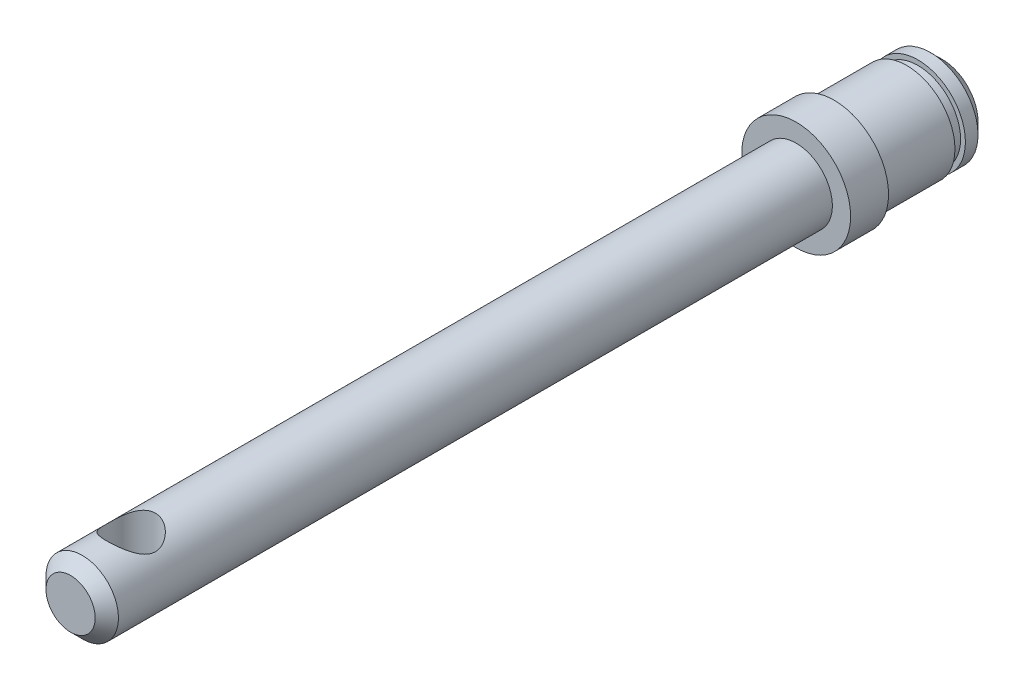
ISO-10303-21;
HEADER;
FILE_DESCRIPTION(('STEP AP214'),'2;1');
FILE_NAME('part.step','',(''),(''),'','','');
FILE_SCHEMA(('AUTOMOTIVE_DESIGN { 1 0 10303 214 1 1 1 1 }'));
ENDSEC;
DATA;
#1=APPLICATION_CONTEXT('core data for automotive mechanical design processes');
#2=APPLICATION_PROTOCOL_DEFINITION('international standard','automotive_design',2000,#1);
#3=PRODUCT_CONTEXT('',#1,'mechanical');
#4=PRODUCT('Part','Part','',(#3));
#5=PRODUCT_RELATED_PRODUCT_CATEGORY('part','',(#4));
#6=PRODUCT_DEFINITION_FORMATION('','',#4);
#7=PRODUCT_DEFINITION_CONTEXT('part definition',#1,'design');
#8=PRODUCT_DEFINITION('design','',#6,#7);
#9=PRODUCT_DEFINITION_SHAPE('','',#8);
#10=(LENGTH_UNIT() NAMED_UNIT(*) SI_UNIT(.MILLI.,.METRE.));
#11=(NAMED_UNIT(*) PLANE_ANGLE_UNIT() SI_UNIT($,.RADIAN.));
#12=(NAMED_UNIT(*) SI_UNIT($,.STERADIAN.) SOLID_ANGLE_UNIT());
#13=UNCERTAINTY_MEASURE_WITH_UNIT(LENGTH_MEASURE(1.E-05),#10,'distance_accuracy_value','');
#14=(GEOMETRIC_REPRESENTATION_CONTEXT(3) GLOBAL_UNCERTAINTY_ASSIGNED_CONTEXT((#13)) GLOBAL_UNIT_ASSIGNED_CONTEXT((#10,
#11,#12)) REPRESENTATION_CONTEXT('',''));
#15=CARTESIAN_POINT('',(0.,0.,0.));
#16=DIRECTION('',(0.,0.,1.));
#17=DIRECTION('',(1.,0.,0.));
#18=AXIS2_PLACEMENT_3D('',#15,#16,#17);
#19=CARTESIAN_POINT('',(0.,0.,-9.5758));
#20=DIRECTION('',(0.,0.,-1.));
#21=DIRECTION('',(-1.,0.,0.));
#22=AXIS2_PLACEMENT_3D('',#19,#20,#21);
#23=PLANE('',#22);
#24=CARTESIAN_POINT('',(0.,0.,-9.57579999993641));
#25=DIRECTION('',(0.,0.,1.));
#26=DIRECTION('',(1.,0.,0.));
#27=AXIS2_PLACEMENT_3D('',#24,#25,#26);
#28=CIRCLE('',#27,2.3494999999798);
#29=CARTESIAN_POINT('',(2.3494999999798,0.,-9.57579999993641));
#30=VERTEX_POINT('',#29);
#31=EDGE_CURVE('E18',#30,#30,#28,.T.);
#32=ORIENTED_EDGE('',*,*,#31,.F.);
#33=EDGE_LOOP('',(#32));
#34=FACE_BOUND('',#33,.T.);
#35=ADVANCED_FACE('F15',(#34),#23,.T.);
#36=CARTESIAN_POINT('',(0.,0.,-8.81380000009813));
#37=DIRECTION('',(0.,0.,1.));
#38=DIRECTION('',(1.,0.,0.));
#39=AXIS2_PLACEMENT_3D('',#36,#37,#38);
#40=CONICAL_SURFACE('',#39,3.11149999987492,0.785398163434747);
#41=ORIENTED_EDGE('',*,*,#31,.T.);
#42=EDGE_LOOP('',(#41));
#43=FACE_BOUND('',#42,.T.);
#44=CARTESIAN_POINT('',(0.,0.,-8.8138));
#45=DIRECTION('',(0.,0.,1.));
#46=DIRECTION('',(1.,0.,0.));
#47=AXIS2_PLACEMENT_3D('',#44,#45,#46);
#48=CIRCLE('',#47,3.1115);
#49=CARTESIAN_POINT('',(3.1115,0.,-8.8138));
#50=VERTEX_POINT('',#49);
#51=EDGE_CURVE('E34',#50,#50,#48,.T.);
#52=ORIENTED_EDGE('',*,*,#51,.F.);
#53=EDGE_LOOP('',(#52));
#54=FACE_BOUND('',#53,.T.);
#55=ADVANCED_FACE('F80',(#43,#54),#40,.T.);
#56=CARTESIAN_POINT('',(0.,0.,-9.5758));
#57=DIRECTION('',(0.,0.,1.));
#58=DIRECTION('',(1.,0.,0.));
#59=AXIS2_PLACEMENT_3D('',#56,#57,#58);
#60=CYLINDRICAL_SURFACE('',#59,3.1115);
#61=ORIENTED_EDGE('',*,*,#51,.T.);
#62=EDGE_LOOP('',(#61));
#63=FACE_BOUND('',#62,.T.);
#64=CARTESIAN_POINT('',(0.,0.,-7.9883));
#65=DIRECTION('',(0.,0.,1.));
#66=DIRECTION('',(1.,0.,0.));
#67=AXIS2_PLACEMENT_3D('',#64,#65,#66);
#68=CIRCLE('',#67,3.1115);
#69=CARTESIAN_POINT('',(3.1115,0.,-7.9883));
#70=VERTEX_POINT('',#69);
#71=EDGE_CURVE('E70',#70,#70,#68,.F.);
#72=ORIENTED_EDGE('',*,*,#71,.T.);
#73=EDGE_LOOP('',(#72));
#74=FACE_BOUND('',#73,.T.);
#75=ADVANCED_FACE('F88',(#63,#74),#60,.T.);
#76=CARTESIAN_POINT('',(0.,0.,-7.9883));
#77=DIRECTION('',(0.,0.,-1.));
#78=DIRECTION('',(-1.,0.,0.));
#79=AXIS2_PLACEMENT_3D('',#76,#77,#78);
#80=PLANE('',#79);
#81=CARTESIAN_POINT('',(0.,0.,-7.9883));
#82=DIRECTION('',(0.,0.,1.));
#83=DIRECTION('',(1.,0.,0.));
#84=AXIS2_PLACEMENT_3D('',#81,#82,#83);
#85=CIRCLE('',#84,2.794);
#86=CARTESIAN_POINT('',(2.794,0.,-7.9883));
#87=VERTEX_POINT('',#86);
#88=EDGE_CURVE('E68',#87,#87,#85,.T.);
#89=ORIENTED_EDGE('',*,*,#88,.F.);
#90=EDGE_LOOP('',(#89));
#91=FACE_BOUND('',#90,.T.);
#92=ORIENTED_EDGE('',*,*,#71,.F.);
#93=EDGE_LOOP('',(#92));
#94=FACE_BOUND('',#93,.T.);
#95=ADVANCED_FACE('F93',(#91,#94),#80,.F.);
#96=CARTESIAN_POINT('',(0.,0.,-7.9883));
#97=DIRECTION('',(0.,0.,1.));
#98=DIRECTION('',(1.,0.,0.));
#99=AXIS2_PLACEMENT_3D('',#96,#97,#98);
#100=CYLINDRICAL_SURFACE('',#99,2.794);
#101=CARTESIAN_POINT('',(0.,0.,-7.2517));
#102=DIRECTION('',(0.,0.,1.));
#103=DIRECTION('',(1.,0.,0.));
#104=AXIS2_PLACEMENT_3D('',#101,#102,#103);
#105=CIRCLE('',#104,2.794);
#106=CARTESIAN_POINT('',(2.794,0.,-7.2517));
#107=VERTEX_POINT('',#106);
#108=EDGE_CURVE('E65',#107,#107,#105,.T.);
#109=ORIENTED_EDGE('',*,*,#108,.F.);
#110=EDGE_LOOP('',(#109));
#111=FACE_BOUND('',#110,.T.);
#112=ORIENTED_EDGE('',*,*,#88,.T.);
#113=EDGE_LOOP('',(#112));
#114=FACE_BOUND('',#113,.T.);
#115=ADVANCED_FACE('F98',(#111,#114),#100,.T.);
#116=CARTESIAN_POINT('',(0.,0.,-7.2517));
#117=DIRECTION('',(0.,0.,-1.));
#118=DIRECTION('',(-1.,0.,0.));
#119=AXIS2_PLACEMENT_3D('',#116,#117,#118);
#120=PLANE('',#119);
#121=ORIENTED_EDGE('',*,*,#108,.T.);
#122=EDGE_LOOP('',(#121));
#123=FACE_BOUND('',#122,.T.);
#124=CARTESIAN_POINT('',(0.,0.,-7.2517));
#125=DIRECTION('',(0.,0.,1.));
#126=DIRECTION('',(1.,0.,0.));
#127=AXIS2_PLACEMENT_3D('',#124,#125,#126);
#128=CIRCLE('',#127,3.1623);
#129=CARTESIAN_POINT('',(3.1623,0.,-7.2517));
#130=VERTEX_POINT('',#129);
#131=EDGE_CURVE('E62',#130,#130,#128,.T.);
#132=ORIENTED_EDGE('',*,*,#131,.F.);
#133=EDGE_LOOP('',(#132));
#134=FACE_BOUND('',#133,.T.);
#135=ADVANCED_FACE('F102',(#123,#134),#120,.T.);
#136=CARTESIAN_POINT('',(0.,0.,-7.2517));
#137=DIRECTION('',(0.,0.,1.));
#138=DIRECTION('',(1.,0.,0.));
#139=AXIS2_PLACEMENT_3D('',#136,#137,#138);
#140=CYLINDRICAL_SURFACE('',#139,3.1623);
#141=ORIENTED_EDGE('',*,*,#131,.T.);
#142=EDGE_LOOP('',(#141));
#143=FACE_BOUND('',#142,.T.);
#144=CARTESIAN_POINT('',(0.,0.,-2.4892));
#145=DIRECTION('',(0.,0.,1.));
#146=DIRECTION('',(1.,0.,0.));
#147=AXIS2_PLACEMENT_3D('',#144,#145,#146);
#148=CIRCLE('',#147,3.1623);
#149=CARTESIAN_POINT('',(3.1623,0.,-2.4892));
#150=VERTEX_POINT('',#149);
#151=EDGE_CURVE('E59',#150,#150,#148,.F.);
#152=ORIENTED_EDGE('',*,*,#151,.T.);
#153=EDGE_LOOP('',(#152));
#154=FACE_BOUND('',#153,.T.);
#155=ADVANCED_FACE('F106',(#143,#154),#140,.T.);
#156=CARTESIAN_POINT('',(0.,0.,-2.4892));
#157=DIRECTION('',(0.,0.,1.));
#158=DIRECTION('',(1.,0.,0.));
#159=AXIS2_PLACEMENT_3D('',#156,#157,#158);
#160=PLANE('',#159);
#161=ORIENTED_EDGE('',*,*,#151,.F.);
#162=EDGE_LOOP('',(#161));
#163=FACE_BOUND('',#162,.T.);
#164=CARTESIAN_POINT('',(0.,0.,-2.4892));
#165=DIRECTION('',(0.,0.,1.));
#166=DIRECTION('',(1.,0.,0.));
#167=AXIS2_PLACEMENT_3D('',#164,#165,#166);
#168=CIRCLE('',#167,3.571875);
#169=CARTESIAN_POINT('',(3.571875,0.,-2.4892));
#170=VERTEX_POINT('',#169);
#171=EDGE_CURVE('E56',#170,#170,#168,.T.);
#172=ORIENTED_EDGE('',*,*,#171,.F.);
#173=EDGE_LOOP('',(#172));
#174=FACE_BOUND('',#173,.T.);
#175=ADVANCED_FACE('F110',(#163,#174),#160,.F.);
#176=CARTESIAN_POINT('',(0.,0.,47.5742));
#177=DIRECTION('',(0.,0.,1.));
#178=DIRECTION('',(1.,0.,0.));
#179=AXIS2_PLACEMENT_3D('',#176,#177,#178);
#180=PLANE('',#179);
#181=CARTESIAN_POINT('',(0.,0.,47.5741999999855));
#182=DIRECTION('',(0.,0.,-1.));
#183=DIRECTION('',(-1.,0.,0.));
#184=AXIS2_PLACEMENT_3D('',#181,#182,#183);
#185=CIRCLE('',#184,1.61289999999781);
#186=CARTESIAN_POINT('',(-1.61289999999781,0.,47.5741999999855));
#187=VERTEX_POINT('',#186);
#188=EDGE_CURVE('E53',#187,#187,#185,.T.);
#189=ORIENTED_EDGE('',*,*,#188,.F.);
#190=EDGE_LOOP('',(#189));
#191=FACE_BOUND('',#190,.T.);
#192=ADVANCED_FACE('F114',(#191),#180,.T.);
#193=CARTESIAN_POINT('',(0.,0.,-2.4892));
#194=DIRECTION('',(0.,0.,1.));
#195=DIRECTION('',(1.,0.,0.));
#196=AXIS2_PLACEMENT_3D('',#193,#194,#195);
#197=CYLINDRICAL_SURFACE('',#196,3.571875);
#198=ORIENTED_EDGE('',*,*,#171,.T.);
#199=EDGE_LOOP('',(#198));
#200=FACE_BOUND('',#199,.T.);
#201=CARTESIAN_POINT('',(0.,0.,0.));
#202=DIRECTION('',(0.,0.,1.));
#203=DIRECTION('',(1.,0.,0.));
#204=AXIS2_PLACEMENT_3D('',#201,#202,#203);
#205=CIRCLE('',#204,3.571875);
#206=CARTESIAN_POINT('',(3.571875,0.,0.));
#207=VERTEX_POINT('',#206);
#208=EDGE_CURVE('E50',#207,#207,#205,.T.);
#209=ORIENTED_EDGE('',*,*,#208,.F.);
#210=EDGE_LOOP('',(#209));
#211=FACE_BOUND('',#210,.T.);
#212=ADVANCED_FACE('F118',(#200,#211),#197,.T.);
#213=CARTESIAN_POINT('',(0.,0.,46.8121999999767));
#214=DIRECTION('',(0.,0.,-1.));
#215=DIRECTION('',(-1.,0.,0.));
#216=AXIS2_PLACEMENT_3D('',#213,#214,#215);
#217=CONICAL_SURFACE('',#216,2.37490000000662,0.785398163397448);
#218=ORIENTED_EDGE('',*,*,#188,.T.);
#219=EDGE_LOOP('',(#218));
#220=FACE_BOUND('',#219,.T.);
#221=CARTESIAN_POINT('',(0.,0.,46.8122));
#222=DIRECTION('',(0.,0.,-1.));
#223=DIRECTION('',(-1.,0.,0.));
#224=AXIS2_PLACEMENT_3D('',#221,#222,#223);
#225=CIRCLE('',#224,2.3749);
#226=CARTESIAN_POINT('',(-2.3749,0.,46.8122));
#227=VERTEX_POINT('',#226);
#228=EDGE_CURVE('E27',#227,#227,#225,.T.);
#229=ORIENTED_EDGE('',*,*,#228,.F.);
#230=EDGE_LOOP('',(#229));
#231=FACE_BOUND('',#230,.T.);
#232=ADVANCED_FACE('F122',(#220,#231),#217,.T.);
#233=CARTESIAN_POINT('',(0.,0.,0.));
#234=DIRECTION('',(0.,0.,1.));
#235=DIRECTION('',(1.,0.,0.));
#236=AXIS2_PLACEMENT_3D('',#233,#234,#235);
#237=PLANE('',#236);
#238=CARTESIAN_POINT('',(0.,0.,0.));
#239=DIRECTION('',(0.,0.,-1.));
#240=DIRECTION('',(-1.,0.,0.));
#241=AXIS2_PLACEMENT_3D('',#238,#239,#240);
#242=CIRCLE('',#241,2.3749);
#243=CARTESIAN_POINT('',(-2.3749,0.,0.));
#244=VERTEX_POINT('',#243);
#245=EDGE_CURVE('E22',#244,#244,#242,.F.);
#246=ORIENTED_EDGE('',*,*,#245,.F.);
#247=EDGE_LOOP('',(#246));
#248=FACE_BOUND('',#247,.T.);
#249=ORIENTED_EDGE('',*,*,#208,.T.);
#250=EDGE_LOOP('',(#249));
#251=FACE_BOUND('',#250,.T.);
#252=ADVANCED_FACE('F125',(#248,#251),#237,.T.);
#253=CARTESIAN_POINT('',(0.,-3.571875,43.60545));
#254=DIRECTION('',(0.,1.,0.));
#255=DIRECTION('',(0.,0.,1.));
#256=AXIS2_PLACEMENT_3D('',#253,#254,#255);
#257=CYLINDRICAL_SURFACE('',#256,1.5875);
#258=CARTESIAN_POINT('',(0.,2.3749,45.19295));
#259=CARTESIAN_POINT('',(-0.0796285021727966,2.37489427166207,45.1929439134093));
#260=CARTESIAN_POINT('',(-0.159333187346092,2.3708547437601,45.1869178453679));
#261=CARTESIAN_POINT('',(-0.316246788253907,2.35507625489168,45.1631617849446));
#262=CARTESIAN_POINT('',(-0.393451638249593,2.34332535323937,45.1454136412255));
#263=CARTESIAN_POINT('',(-0.542790518515763,2.31328830758023,45.0993083312295));
#264=CARTESIAN_POINT('',(-0.614948378456795,2.29503576257873,45.0710056736267));
#265=CARTESIAN_POINT('',(-0.753178545236462,2.25346165524091,45.0050040485006));
#266=CARTESIAN_POINT('',(-0.819251194999285,2.23014037879558,44.9673056109087));
#267=CARTESIAN_POINT('',(-0.949807131451189,2.17792784028168,44.8800881288627));
#268=CARTESIAN_POINT('',(-1.01367601133952,2.14873138397025,44.8298358883516));
#269=CARTESIAN_POINT('',(-1.13266066753279,2.0884656766868,44.7206931180195));
#270=CARTESIAN_POINT('',(-1.18776336726205,2.05739372150985,44.6617899306125));
#271=CARTESIAN_POINT('',(-1.29659427145063,1.99089626995362,44.5261680967343));
#272=CARTESIAN_POINT('',(-1.34871636553572,1.95556248733199,44.4481056626616));
#273=CARTESIAN_POINT('',(-1.43904349853149,1.89008374794265,44.2823403381314));
#274=CARTESIAN_POINT('',(-1.4772725865024,1.85992987284409,44.1946544520516));
#275=CARTESIAN_POINT('',(-1.52904517834333,1.81740283377534,44.0377472795276));
#276=CARTESIAN_POINT('',(-1.54653236351236,1.80240921282223,43.9705447171603));
#277=CARTESIAN_POINT('',(-1.57261168441343,1.77970474695812,43.8332848433952));
#278=CARTESIAN_POINT('',(-1.58121930044462,1.7719812296935,43.763232722255));
#279=CARTESIAN_POINT('',(-1.58899802612375,1.76501215254764,43.6218716388384));
#280=CARTESIAN_POINT('',(-1.58812985724121,1.76580188116326,43.5505586693621));
#281=CARTESIAN_POINT('',(-1.57692650593038,1.77581049841768,43.4092572197684));
#282=CARTESIAN_POINT('',(-1.56658327442516,1.7850365537139,43.3392699174096));
#283=CARTESIAN_POINT('',(-1.53778680769931,1.80988877384798,43.2056567626746));
#284=CARTESIAN_POINT('',(-1.51972103829905,1.82520699487101,43.1418863605764));
#285=CARTESIAN_POINT('',(-1.47635800673587,1.86045582345457,43.0182351850859));
#286=CARTESIAN_POINT('',(-1.45105836975688,1.88038794530891,42.9583556969829));
#287=CARTESIAN_POINT('',(-1.38804369169894,1.92751840139636,42.8311724358925));
#288=CARTESIAN_POINT('',(-1.34884877883874,1.95536954816995,42.7648460457442));
#289=CARTESIAN_POINT('',(-1.26169992826936,2.01270750683002,42.6389401049234));
#290=CARTESIAN_POINT('',(-1.21373539144903,2.04219626760565,42.5793688613398));
#291=CARTESIAN_POINT('',(-1.09822042057742,2.10697571698643,42.4553504562286));
#292=CARTESIAN_POINT('',(-1.02867941502371,2.14213147691545,42.3926663982129));
#293=CARTESIAN_POINT('',(-0.87829590652397,2.20804612806214,42.2797162875604));
#294=CARTESIAN_POINT('',(-0.797461070213304,2.23880797360637,42.2294418743602));
#295=CARTESIAN_POINT('',(-0.642794196366182,2.28740091649053,42.151857840345));
#296=CARTESIAN_POINT('',(-0.570673934887535,2.30658392602361,42.1219812810788));
#297=CARTESIAN_POINT('',(-0.421590346714549,2.33841465201831,42.0729550712348));
#298=CARTESIAN_POINT('',(-0.344638477425361,2.35107721947041,42.05378103609));
#299=CARTESIAN_POINT('',(-0.222529004084351,2.36486476954346,42.0329936390966));
#300=CARTESIAN_POINT('',(-0.178308116016056,2.36861511899109,42.0273651451537));
#301=CARTESIAN_POINT('',(-0.0893995612791168,2.37363462559172,42.0198411908061));
#302=CARTESIAN_POINT('',(-0.0447117904210668,2.37490321648955,42.0179465823498));
#303=CARTESIAN_POINT('',(0.0796285021727959,2.37489427166207,42.0179560865907));
#304=CARTESIAN_POINT('',(0.159333187346092,2.3708547437601,42.0239821546321));
#305=CARTESIAN_POINT('',(0.316246788253906,2.35507625489168,42.0477382150553));
#306=CARTESIAN_POINT('',(0.393451638249593,2.34332535323937,42.0654863587745));
#307=CARTESIAN_POINT('',(0.542790518515763,2.31328830758023,42.1115916687705));
#308=CARTESIAN_POINT('',(0.614948378456795,2.29503576257873,42.1398943263733));
#309=CARTESIAN_POINT('',(0.753178545236463,2.25346165524091,42.2058959514994));
#310=CARTESIAN_POINT('',(0.819251194999285,2.23014037879558,42.2435943890913));
#311=CARTESIAN_POINT('',(0.949807131451189,2.17792784028168,42.3308118711373));
#312=CARTESIAN_POINT('',(1.01367601133952,2.14873138397025,42.3810641116484));
#313=CARTESIAN_POINT('',(1.13266066753279,2.0884656766868,42.4902068819805));
#314=CARTESIAN_POINT('',(1.18776336726205,2.05739372150985,42.5491100693874));
#315=CARTESIAN_POINT('',(1.29659427145063,1.99089626995362,42.6847319032657));
#316=CARTESIAN_POINT('',(1.34871636553572,1.95556248733199,42.7627943373384));
#317=CARTESIAN_POINT('',(1.43904349853149,1.89008374794265,42.9285596618686));
#318=CARTESIAN_POINT('',(1.4772725865024,1.85992987284409,43.0162455479484));
#319=CARTESIAN_POINT('',(1.52904517834333,1.81740283377534,43.1731527204724));
#320=CARTESIAN_POINT('',(1.54653236351236,1.80240921282223,43.2403552828397));
#321=CARTESIAN_POINT('',(1.57261168441343,1.77970474695812,43.3776151566048));
#322=CARTESIAN_POINT('',(1.58121930044462,1.7719812296935,43.447667277745));
#323=CARTESIAN_POINT('',(1.58899802612375,1.76501215254764,43.5890283611616));
#324=CARTESIAN_POINT('',(1.58812985724121,1.76580188116326,43.6603413306379));
#325=CARTESIAN_POINT('',(1.57692650593038,1.77581049841768,43.8016427802316));
#326=CARTESIAN_POINT('',(1.56658327442517,1.7850365537139,43.8716300825904));
#327=CARTESIAN_POINT('',(1.53778680769931,1.80988877384798,44.0052432373254));
#328=CARTESIAN_POINT('',(1.51972103829905,1.825206994871,44.0690136394236));
#329=CARTESIAN_POINT('',(1.47635800673587,1.86045582345457,44.192664814914));
#330=CARTESIAN_POINT('',(1.45105836975689,1.88038794530891,44.2525443030171));
#331=CARTESIAN_POINT('',(1.38804369169894,1.92751840139636,44.3797275641075));
#332=CARTESIAN_POINT('',(1.34884877883874,1.95536954816995,44.4460539542558));
#333=CARTESIAN_POINT('',(1.26169992826936,2.01270750683002,44.5719598950766));
#334=CARTESIAN_POINT('',(1.21373539144903,2.04219626760564,44.6315311386602));
#335=CARTESIAN_POINT('',(1.09822042057742,2.10697571698643,44.7555495437714));
#336=CARTESIAN_POINT('',(1.02867941502371,2.14213147691544,44.8182336017871));
#337=CARTESIAN_POINT('',(0.87829590652398,2.20804612806214,44.9311837124396));
#338=CARTESIAN_POINT('',(0.797461070213316,2.23880797360636,44.9814581256398));
#339=CARTESIAN_POINT('',(0.642794196366197,2.28740091649053,45.059042159655));
#340=CARTESIAN_POINT('',(0.57067393488755,2.30658392602361,45.0889187189212));
#341=CARTESIAN_POINT('',(0.421590346714565,2.33841465201831,45.1379449287651));
#342=CARTESIAN_POINT('',(0.344638477425378,2.3510772194704,45.15711896391));
#343=CARTESIAN_POINT('',(0.222529004084365,2.36486476954346,45.1779063609034));
#344=CARTESIAN_POINT('',(0.178308116016067,2.36861511899109,45.1835348548463));
#345=CARTESIAN_POINT('',(0.0893995612791212,2.37363462559172,45.1910588091939));
#346=CARTESIAN_POINT('',(0.0447117904210687,2.37490321648955,45.1929534176502));
#347=CARTESIAN_POINT('',(0.,2.3749,45.19295));
#348=B_SPLINE_CURVE_WITH_KNOTS('',3,(#258,#259,#260,#261,#262,#263,#264,#265,#266,#267,#268,
#269,#270,#271,#272,#273,#274,#275,#276,#277,#278,#279,#280,#281,#282,#283,#284,#285,#286,#287,
#288,#289,#290,#291,#292,#293,#294,#295,#296,#297,#298,#299,#300,#301,#302,#303,#304,#305,#306,
#307,#308,#309,#310,#311,#312,#313,#314,#315,#316,#317,#318,#319,#320,#321,#322,#323,#324,#325,
#326,#327,#328,#329,#330,#331,#332,#333,#334,#335,#336,#337,#338,#339,#340,#341,#342,#343,#344,
#345,#346,#347),.UNSPECIFIED.,.T.,.F.,(4,2,2,2,2,2,2,2,2,2,2,2,2,2,2,2,2,2,2,2,2,2,2,2,2,2,2,2,
2,2,2,2,2,2,2,2,2,2,2,2,2,2,2,2,4),(0.,0.238700395852421,0.477771282535445,0.71562421428543,
0.95346373392742,1.21155549797826,1.47002872073382,1.76952408912618,2.06849852769238,
2.28077891750231,2.49268859719911,2.70547700634111,2.9184463472867,3.12179507761272,
3.32521064236503,3.57012288877609,3.815333120713,4.1139409115089,4.41234697329097,
4.65252034508975,4.89214425005817,5.02614510978654,5.16017654051243,5.39887693636485,
5.63794782304788,5.87580075479786,6.11364027443985,6.37173203849069,6.63020526124625,
6.92970062963861,7.22867506820481,7.44095545801474,7.65286513771153,7.86565354685354,
8.07862288779913,8.28197161812515,8.48538718287745,8.73029942928851,8.97550966122542,
9.27411745202132,9.57252351380338,9.81269688560216,10.0523207905706,10.186321650299,
10.3203530810249),.UNSPECIFIED.);
#349=CARTESIAN_POINT('',(0.,2.3749,45.19295));
#350=VERTEX_POINT('',#349);
#351=EDGE_CURVE('E45',#350,#350,#348,.T.);
#352=ORIENTED_EDGE('',*,*,#351,.F.);
#353=EDGE_LOOP('',(#352));
#354=FACE_BOUND('',#353,.T.);
#355=CARTESIAN_POINT('',(0.,-2.3749,45.19295));
#356=CARTESIAN_POINT('',(0.079628502172797,-2.37489427166208,45.1929439134093));
#357=CARTESIAN_POINT('',(0.159333187346093,-2.3708547437601,45.1869178453679));
#358=CARTESIAN_POINT('',(0.316246788253907,-2.35507625489168,45.1631617849446));
#359=CARTESIAN_POINT('',(0.393451638249594,-2.34332535323937,45.1454136412255));
#360=CARTESIAN_POINT('',(0.542790518515763,-2.31328830758023,45.0993083312295));
#361=CARTESIAN_POINT('',(0.614948378456796,-2.29503576257873,45.0710056736267));
#362=CARTESIAN_POINT('',(0.753178545236462,-2.25346165524091,45.0050040485006));
#363=CARTESIAN_POINT('',(0.819251194999285,-2.23014037879558,44.9673056109087));
#364=CARTESIAN_POINT('',(0.949807131451189,-2.17792784028168,44.8800881288627));
#365=CARTESIAN_POINT('',(1.01367601133952,-2.14873138397025,44.8298358883516));
#366=CARTESIAN_POINT('',(1.13266066753279,-2.0884656766868,44.7206931180195));
#367=CARTESIAN_POINT('',(1.18776336726205,-2.05739372150985,44.6617899306125));
#368=CARTESIAN_POINT('',(1.29659427145063,-1.99089626995362,44.5261680967343));
#369=CARTESIAN_POINT('',(1.34871636553572,-1.95556248733199,44.4481056626616));
#370=CARTESIAN_POINT('',(1.43904349853149,-1.89008374794265,44.2823403381314));
#371=CARTESIAN_POINT('',(1.4772725865024,-1.85992987284409,44.1946544520516));
#372=CARTESIAN_POINT('',(1.52904517834333,-1.81740283377534,44.0377472795276));
#373=CARTESIAN_POINT('',(1.54653236351237,-1.80240921282223,43.9705447171602));
#374=CARTESIAN_POINT('',(1.57261168441344,-1.77970474695812,43.8332848433952));
#375=CARTESIAN_POINT('',(1.58121930044462,-1.7719812296935,43.763232722255));
#376=CARTESIAN_POINT('',(1.58899802612375,-1.76501215254764,43.6218716388384));
#377=CARTESIAN_POINT('',(1.58812985724121,-1.76580188116326,43.5505586693621));
#378=CARTESIAN_POINT('',(1.57692650593038,-1.77581049841768,43.4092572197684));
#379=CARTESIAN_POINT('',(1.56658327442516,-1.7850365537139,43.3392699174096));
#380=CARTESIAN_POINT('',(1.53778680769931,-1.80988877384798,43.2056567626746));
#381=CARTESIAN_POINT('',(1.51972103829905,-1.82520699487101,43.1418863605764));
#382=CARTESIAN_POINT('',(1.47635800673587,-1.86045582345457,43.0182351850859));
#383=CARTESIAN_POINT('',(1.45105836975688,-1.88038794530891,42.9583556969829));
#384=CARTESIAN_POINT('',(1.38804369169894,-1.92751840139636,42.8311724358925));
#385=CARTESIAN_POINT('',(1.34884877883874,-1.95536954816995,42.7648460457442));
#386=CARTESIAN_POINT('',(1.26169992826936,-2.01270750683002,42.6389401049234));
#387=CARTESIAN_POINT('',(1.21373539144903,-2.04219626760565,42.5793688613398));
#388=CARTESIAN_POINT('',(1.09822042057742,-2.10697571698643,42.4553504562286));
#389=CARTESIAN_POINT('',(1.0286794150237,-2.14213147691545,42.3926663982129));
#390=CARTESIAN_POINT('',(0.878295906523966,-2.20804612806214,42.2797162875604));
#391=CARTESIAN_POINT('',(0.797461070213302,-2.23880797360637,42.2294418743602));
#392=CARTESIAN_POINT('',(0.642794196366183,-2.28740091649053,42.151857840345));
#393=CARTESIAN_POINT('',(0.570673934887537,-2.30658392602361,42.1219812810788));
#394=CARTESIAN_POINT('',(0.421590346714551,-2.33841465201831,42.0729550712348));
#395=CARTESIAN_POINT('',(0.344638477425362,-2.35107721947041,42.05378103609));
#396=CARTESIAN_POINT('',(0.22252900408435,-2.36486476954346,42.0329936390966));
#397=CARTESIAN_POINT('',(0.178308116016056,-2.36861511899109,42.0273651451537));
#398=CARTESIAN_POINT('',(0.0893995612791169,-2.37363462559172,42.0198411908061));
#399=CARTESIAN_POINT('',(0.0447117904210671,-2.37490321648955,42.0179465823498));
#400=CARTESIAN_POINT('',(-0.0796285021727957,-2.37489427166208,42.0179560865907));
#401=CARTESIAN_POINT('',(-0.159333187346092,-2.3708547437601,42.0239821546321));
#402=CARTESIAN_POINT('',(-0.316246788253906,-2.35507625489168,42.0477382150553));
#403=CARTESIAN_POINT('',(-0.393451638249593,-2.34332535323937,42.0654863587745));
#404=CARTESIAN_POINT('',(-0.542790518515762,-2.31328830758023,42.1115916687705));
#405=CARTESIAN_POINT('',(-0.614948378456795,-2.29503576257873,42.1398943263733));
#406=CARTESIAN_POINT('',(-0.753178545236462,-2.25346165524091,42.2058959514994));
#407=CARTESIAN_POINT('',(-0.819251194999284,-2.23014037879558,42.2435943890913));
#408=CARTESIAN_POINT('',(-0.949807131451189,-2.17792784028168,42.3308118711373));
#409=CARTESIAN_POINT('',(-1.01367601133952,-2.14873138397025,42.3810641116484));
#410=CARTESIAN_POINT('',(-1.13266066753279,-2.0884656766868,42.4902068819805));
#411=CARTESIAN_POINT('',(-1.18776336726205,-2.05739372150985,42.5491100693874));
#412=CARTESIAN_POINT('',(-1.29659427145063,-1.99089626995362,42.6847319032657));
#413=CARTESIAN_POINT('',(-1.34871636553572,-1.95556248733199,42.7627943373384));
#414=CARTESIAN_POINT('',(-1.43904349853149,-1.89008374794265,42.9285596618686));
#415=CARTESIAN_POINT('',(-1.4772725865024,-1.85992987284409,43.0162455479484));
#416=CARTESIAN_POINT('',(-1.52904517834333,-1.81740283377534,43.1731527204724));
#417=CARTESIAN_POINT('',(-1.54653236351237,-1.80240921282223,43.2403552828398));
#418=CARTESIAN_POINT('',(-1.57261168441344,-1.77970474695812,43.3776151566048));
#419=CARTESIAN_POINT('',(-1.58121930044462,-1.7719812296935,43.447667277745));
#420=CARTESIAN_POINT('',(-1.58899802612375,-1.76501215254764,43.5890283611616));
#421=CARTESIAN_POINT('',(-1.58812985724121,-1.76580188116326,43.6603413306379));
#422=CARTESIAN_POINT('',(-1.57692650593038,-1.77581049841768,43.8016427802316));
#423=CARTESIAN_POINT('',(-1.56658327442516,-1.7850365537139,43.8716300825904));
#424=CARTESIAN_POINT('',(-1.53778680769931,-1.80988877384798,44.0052432373254));
#425=CARTESIAN_POINT('',(-1.51972103829905,-1.82520699487101,44.0690136394236));
#426=CARTESIAN_POINT('',(-1.47635800673587,-1.86045582345457,44.192664814914));
#427=CARTESIAN_POINT('',(-1.45105836975688,-1.88038794530891,44.2525443030171));
#428=CARTESIAN_POINT('',(-1.38804369169894,-1.92751840139636,44.3797275641075));
#429=CARTESIAN_POINT('',(-1.34884877883874,-1.95536954816995,44.4460539542558));
#430=CARTESIAN_POINT('',(-1.26169992826936,-2.01270750683002,44.5719598950766));
#431=CARTESIAN_POINT('',(-1.21373539144903,-2.04219626760565,44.6315311386602));
#432=CARTESIAN_POINT('',(-1.09822042057742,-2.10697571698643,44.7555495437714));
#433=CARTESIAN_POINT('',(-1.02867941502371,-2.14213147691544,44.8182336017871));
#434=CARTESIAN_POINT('',(-0.878295906523972,-2.20804612806214,44.9311837124396));
#435=CARTESIAN_POINT('',(-0.797461070213305,-2.23880797360637,44.9814581256398));
#436=CARTESIAN_POINT('',(-0.642794196366183,-2.28740091649053,45.059042159655));
#437=CARTESIAN_POINT('',(-0.570673934887537,-2.30658392602361,45.0889187189212));
#438=CARTESIAN_POINT('',(-0.421590346714551,-2.33841465201831,45.1379449287651));
#439=CARTESIAN_POINT('',(-0.344638477425362,-2.35107721947041,45.15711896391));
#440=CARTESIAN_POINT('',(-0.22252900408435,-2.36486476954346,45.1779063609034));
#441=CARTESIAN_POINT('',(-0.178308116016055,-2.36861511899109,45.1835348548463));
#442=CARTESIAN_POINT('',(-0.0893995612791154,-2.37363462559172,45.1910588091939));
#443=CARTESIAN_POINT('',(-0.0447117904210655,-2.37490321648955,45.1929534176502));
#444=CARTESIAN_POINT('',(0.,-2.3749,45.19295));
#445=B_SPLINE_CURVE_WITH_KNOTS('',3,(#355,#356,#357,#358,#359,#360,#361,#362,#363,#364,#365,
#366,#367,#368,#369,#370,#371,#372,#373,#374,#375,#376,#377,#378,#379,#380,#381,#382,#383,#384,
#385,#386,#387,#388,#389,#390,#391,#392,#393,#394,#395,#396,#397,#398,#399,#400,#401,#402,#403,
#404,#405,#406,#407,#408,#409,#410,#411,#412,#413,#414,#415,#416,#417,#418,#419,#420,#421,#422,
#423,#424,#425,#426,#427,#428,#429,#430,#431,#432,#433,#434,#435,#436,#437,#438,#439,#440,#441,
#442,#443,#444),.UNSPECIFIED.,.T.,.F.,(4,2,2,2,2,2,2,2,2,2,2,2,2,2,2,2,2,2,2,2,2,2,2,2,2,2,2,2,
2,2,2,2,2,2,2,2,2,2,2,2,2,2,2,2,4),(0.,0.238700395852421,0.477771282535445,0.71562421428543,
0.953463733927419,1.21155549797826,1.47002872073382,1.76952408912618,2.06849852769238,
2.28077891750232,2.49268859719911,2.70547700634111,2.9184463472867,3.12179507761272,
3.32521064236503,3.57012288877609,3.815333120713,4.11394091150891,4.41234697329097,
4.65252034508974,4.89214425005817,5.02614510978654,5.16017654051243,5.39887693636485,
5.63794782304788,5.87580075479786,6.11364027443985,6.37173203849069,6.63020526124625,
6.92970062963861,7.22867506820481,7.44095545801475,7.65286513771154,7.86565354685354,
8.07862288779913,8.28197161812515,8.48538718287746,8.73029942928852,8.97550966122543,
9.27411745202133,9.5725235138034,9.81269688560218,10.0523207905706,10.186321650299,
10.3203530810249),.UNSPECIFIED.);
#446=CARTESIAN_POINT('',(0.,-2.3749,45.19295));
#447=VERTEX_POINT('',#446);
#448=EDGE_CURVE('E10',#447,#447,#445,.T.);
#449=ORIENTED_EDGE('',*,*,#448,.F.);
#450=EDGE_LOOP('',(#449));
#451=FACE_BOUND('',#450,.T.);
#452=ADVANCED_FACE('F37',(#354,#451),#257,.F.);
#453=CARTESIAN_POINT('',(0.,0.,47.5742));
#454=DIRECTION('',(0.,0.,-1.));
#455=DIRECTION('',(-1.,0.,0.));
#456=AXIS2_PLACEMENT_3D('',#453,#454,#455);
#457=CYLINDRICAL_SURFACE('',#456,2.3749);
#458=ORIENTED_EDGE('',*,*,#228,.T.);
#459=EDGE_LOOP('',(#458));
#460=FACE_BOUND('',#459,.T.);
#461=ORIENTED_EDGE('',*,*,#448,.T.);
#462=EDGE_LOOP('',(#461));
#463=FACE_BOUND('',#462,.T.);
#464=ORIENTED_EDGE('',*,*,#245,.T.);
#465=EDGE_LOOP('',(#464));
#466=FACE_BOUND('',#465,.T.);
#467=ORIENTED_EDGE('',*,*,#351,.T.);
#468=EDGE_LOOP('',(#467));
#469=FACE_BOUND('',#468,.T.);
#470=ADVANCED_FACE('F40',(#460,#463,#466,#469),#457,.T.);
#471=CLOSED_SHELL('',(#35,#55,#75,#95,#115,#135,#155,#175,#192,#212,#232,#252,#452,#470));
#472=MANIFOLD_SOLID_BREP('B1',#471);
#473=ADVANCED_BREP_SHAPE_REPRESENTATION('',(#18,#472),#14);
#474=SHAPE_DEFINITION_REPRESENTATION(#9,#473);
ENDSEC;
END-ISO-10303-21;
